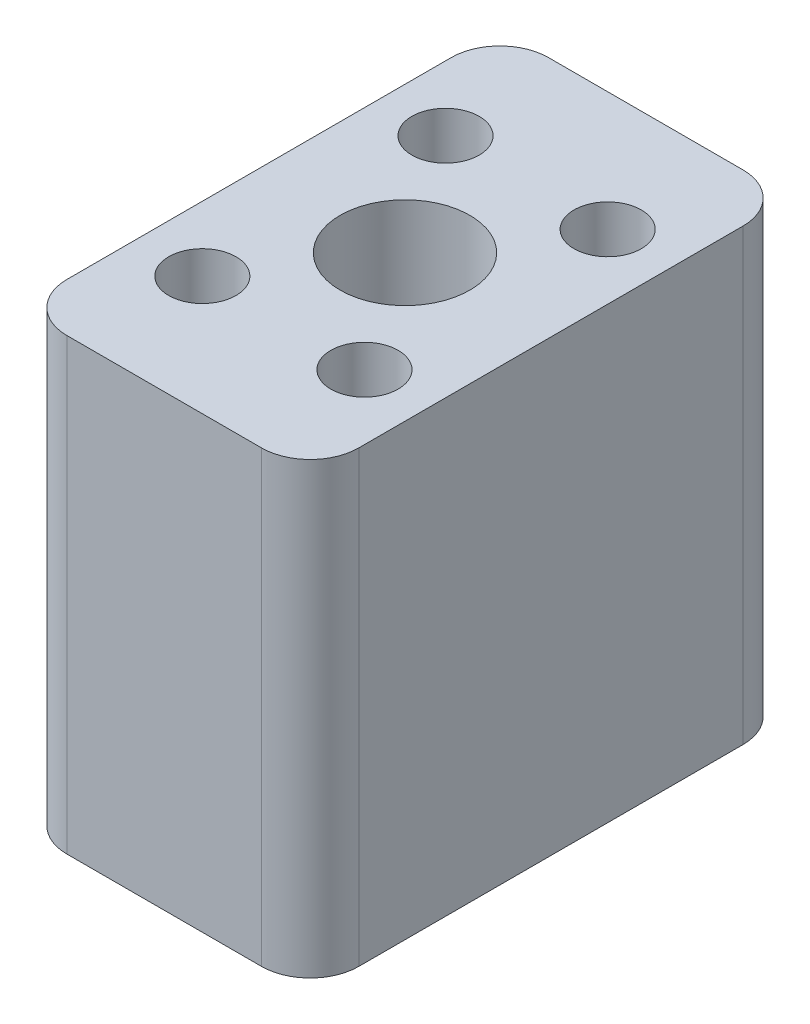
ISO-10303-21;
HEADER;
FILE_DESCRIPTION(('STEP AP214'),'2;1');
FILE_NAME('part.step','',(''),(''),'','','');
FILE_SCHEMA(('AUTOMOTIVE_DESIGN { 1 0 10303 214 1 1 1 1 }'));
ENDSEC;
DATA;
#1=APPLICATION_CONTEXT('core data for automotive mechanical design processes');
#2=APPLICATION_PROTOCOL_DEFINITION('international standard','automotive_design',2000,#1);
#3=PRODUCT_CONTEXT('',#1,'mechanical');
#4=PRODUCT('Part','Part','',(#3));
#5=PRODUCT_RELATED_PRODUCT_CATEGORY('part','',(#4));
#6=PRODUCT_DEFINITION_FORMATION('','',#4);
#7=PRODUCT_DEFINITION_CONTEXT('part definition',#1,'design');
#8=PRODUCT_DEFINITION('design','',#6,#7);
#9=PRODUCT_DEFINITION_SHAPE('','',#8);
#10=(LENGTH_UNIT() NAMED_UNIT(*) SI_UNIT(.MILLI.,.METRE.));
#11=(NAMED_UNIT(*) PLANE_ANGLE_UNIT() SI_UNIT($,.RADIAN.));
#12=(NAMED_UNIT(*) SI_UNIT($,.STERADIAN.) SOLID_ANGLE_UNIT());
#13=UNCERTAINTY_MEASURE_WITH_UNIT(LENGTH_MEASURE(1.E-05),#10,'distance_accuracy_value','');
#14=(GEOMETRIC_REPRESENTATION_CONTEXT(3) GLOBAL_UNCERTAINTY_ASSIGNED_CONTEXT((#13)) GLOBAL_UNIT_ASSIGNED_CONTEXT((#10,
#11,#12)) REPRESENTATION_CONTEXT('',''));
#15=CARTESIAN_POINT('',(0.,0.,0.));
#16=DIRECTION('',(0.,0.,1.));
#17=DIRECTION('',(1.,0.,0.));
#18=AXIS2_PLACEMENT_3D('',#15,#16,#17);
#19=CARTESIAN_POINT('',(9.,27.7,14.85));
#20=DIRECTION('',(-1.,0.,0.));
#21=DIRECTION('',(0.,0.,1.));
#22=AXIS2_PLACEMENT_3D('',#19,#20,#21);
#23=PLANE('',#22);
#24=DIRECTION('',(0.,0.,-1.));
#25=VECTOR('',#24,1.);
#26=CARTESIAN_POINT('',(9.,27.7,14.85));
#27=LINE('',#26,#25);
#28=CARTESIAN_POINT('',(9.,27.7,11.85));
#29=VERTEX_POINT('',#28);
#30=CARTESIAN_POINT('',(9.,27.7,-11.85));
#31=VERTEX_POINT('',#30);
#32=EDGE_CURVE('E120',#29,#31,#27,.T.);
#33=ORIENTED_EDGE('',*,*,#32,.F.);
#34=DIRECTION('',(0.,-1.,0.));
#35=VECTOR('',#34,1.);
#36=CARTESIAN_POINT('',(9.,27.7,11.85));
#37=LINE('',#36,#35);
#38=CARTESIAN_POINT('',(9.,0.,11.85));
#39=VERTEX_POINT('',#38);
#40=EDGE_CURVE('E105',#29,#39,#37,.T.);
#41=ORIENTED_EDGE('',*,*,#40,.T.);
#42=DIRECTION('',(0.,0.,-1.));
#43=VECTOR('',#42,1.);
#44=CARTESIAN_POINT('',(9.,0.,14.85));
#45=LINE('',#44,#43);
#46=CARTESIAN_POINT('',(9.,0.,-11.85));
#47=VERTEX_POINT('',#46);
#48=EDGE_CURVE('E117',#39,#47,#45,.T.);
#49=ORIENTED_EDGE('',*,*,#48,.T.);
#50=DIRECTION('',(0.,-1.,0.));
#51=VECTOR('',#50,1.);
#52=CARTESIAN_POINT('',(9.,27.7,-11.85));
#53=LINE('',#52,#51);
#54=EDGE_CURVE('E122',#47,#31,#53,.F.);
#55=ORIENTED_EDGE('',*,*,#54,.T.);
#56=EDGE_LOOP('',(#33,#41,#49,#55));
#57=FACE_BOUND('',#56,.T.);
#58=ADVANCED_FACE('F35',(#57),#23,.F.);
#59=CARTESIAN_POINT('',(-9.,27.7,-14.85));
#60=DIRECTION('',(0.,0.,1.));
#61=DIRECTION('',(1.,0.,0.));
#62=AXIS2_PLACEMENT_3D('',#59,#60,#61);
#63=PLANE('',#62);
#64=DIRECTION('',(-1.,0.,0.));
#65=VECTOR('',#64,1.);
#66=CARTESIAN_POINT('',(-9.,0.,-14.85));
#67=LINE('',#66,#65);
#68=CARTESIAN_POINT('',(6.,0.,-14.85));
#69=VERTEX_POINT('',#68);
#70=CARTESIAN_POINT('',(-6.,0.,-14.85));
#71=VERTEX_POINT('',#70);
#72=EDGE_CURVE('E126',#69,#71,#67,.T.);
#73=ORIENTED_EDGE('',*,*,#72,.T.);
#74=DIRECTION('',(0.,-1.,0.));
#75=VECTOR('',#74,1.);
#76=CARTESIAN_POINT('',(-6.,27.7,-14.85));
#77=LINE('',#76,#75);
#78=CARTESIAN_POINT('',(-6.,27.7,-14.85));
#79=VERTEX_POINT('',#78);
#80=EDGE_CURVE('E11',#71,#79,#77,.F.);
#81=ORIENTED_EDGE('',*,*,#80,.T.);
#82=DIRECTION('',(-1.,0.,0.));
#83=VECTOR('',#82,1.);
#84=CARTESIAN_POINT('',(-9.,27.7,-14.85));
#85=LINE('',#84,#83);
#86=CARTESIAN_POINT('',(6.,27.7,-14.85));
#87=VERTEX_POINT('',#86);
#88=EDGE_CURVE('E166',#87,#79,#85,.T.);
#89=ORIENTED_EDGE('',*,*,#88,.F.);
#90=DIRECTION('',(0.,-1.,0.));
#91=VECTOR('',#90,1.);
#92=CARTESIAN_POINT('',(6.,27.7,-14.85));
#93=LINE('',#92,#91);
#94=EDGE_CURVE('E43',#87,#69,#93,.T.);
#95=ORIENTED_EDGE('',*,*,#94,.T.);
#96=EDGE_LOOP('',(#73,#81,#89,#95));
#97=FACE_BOUND('',#96,.T.);
#98=ADVANCED_FACE('F164',(#97),#63,.F.);
#99=CARTESIAN_POINT('',(-9.,27.7,14.85));
#100=DIRECTION('',(1.,0.,0.));
#101=DIRECTION('',(0.,0.,-1.));
#102=AXIS2_PLACEMENT_3D('',#99,#100,#101);
#103=PLANE('',#102);
#104=DIRECTION('',(0.,0.,1.));
#105=VECTOR('',#104,1.);
#106=CARTESIAN_POINT('',(-9.,0.,14.85));
#107=LINE('',#106,#105);
#108=CARTESIAN_POINT('',(-9.,0.,-11.85));
#109=VERTEX_POINT('',#108);
#110=CARTESIAN_POINT('',(-9.,0.,11.85));
#111=VERTEX_POINT('',#110);
#112=EDGE_CURVE('E130',#109,#111,#107,.T.);
#113=ORIENTED_EDGE('',*,*,#112,.T.);
#114=DIRECTION('',(0.,-1.,0.));
#115=VECTOR('',#114,1.);
#116=CARTESIAN_POINT('',(-9.,27.7,11.85));
#117=LINE('',#116,#115);
#118=CARTESIAN_POINT('',(-9.,27.7,11.85));
#119=VERTEX_POINT('',#118);
#120=EDGE_CURVE('E50',#111,#119,#117,.F.);
#121=ORIENTED_EDGE('',*,*,#120,.T.);
#122=DIRECTION('',(0.,0.,1.));
#123=VECTOR('',#122,1.);
#124=CARTESIAN_POINT('',(-9.,27.7,14.85));
#125=LINE('',#124,#123);
#126=CARTESIAN_POINT('',(-9.,27.7,-11.85));
#127=VERTEX_POINT('',#126);
#128=EDGE_CURVE('E174',#127,#119,#125,.T.);
#129=ORIENTED_EDGE('',*,*,#128,.F.);
#130=DIRECTION('',(0.,-1.,0.));
#131=VECTOR('',#130,1.);
#132=CARTESIAN_POINT('',(-9.,27.7,-11.85));
#133=LINE('',#132,#131);
#134=EDGE_CURVE('E157',#127,#109,#133,.T.);
#135=ORIENTED_EDGE('',*,*,#134,.T.);
#136=EDGE_LOOP('',(#113,#121,#129,#135));
#137=FACE_BOUND('',#136,.T.);
#138=ADVANCED_FACE('F173',(#137),#103,.F.);
#139=CARTESIAN_POINT('',(-9.,27.7,14.85));
#140=DIRECTION('',(0.,0.,-1.));
#141=DIRECTION('',(-1.,0.,0.));
#142=AXIS2_PLACEMENT_3D('',#139,#140,#141);
#143=PLANE('',#142);
#144=DIRECTION('',(1.,0.,0.));
#145=VECTOR('',#144,1.);
#146=CARTESIAN_POINT('',(-9.,0.,14.85));
#147=LINE('',#146,#145);
#148=CARTESIAN_POINT('',(-6.,0.,14.85));
#149=VERTEX_POINT('',#148);
#150=CARTESIAN_POINT('',(6.,0.,14.85));
#151=VERTEX_POINT('',#150);
#152=EDGE_CURVE('E140',#149,#151,#147,.T.);
#153=ORIENTED_EDGE('',*,*,#152,.T.);
#154=DIRECTION('',(0.,-1.,0.));
#155=VECTOR('',#154,1.);
#156=CARTESIAN_POINT('',(6.,27.7,14.85));
#157=LINE('',#156,#155);
#158=CARTESIAN_POINT('',(6.,27.7,14.85));
#159=VERTEX_POINT('',#158);
#160=EDGE_CURVE('E106',#151,#159,#157,.F.);
#161=ORIENTED_EDGE('',*,*,#160,.T.);
#162=DIRECTION('',(1.,0.,0.));
#163=VECTOR('',#162,1.);
#164=CARTESIAN_POINT('',(-9.,27.7,14.85));
#165=LINE('',#164,#163);
#166=CARTESIAN_POINT('',(-6.,27.7,14.85));
#167=VERTEX_POINT('',#166);
#168=EDGE_CURVE('E136',#167,#159,#165,.T.);
#169=ORIENTED_EDGE('',*,*,#168,.F.);
#170=DIRECTION('',(0.,-1.,0.));
#171=VECTOR('',#170,1.);
#172=CARTESIAN_POINT('',(-6.,27.7,14.85));
#173=LINE('',#172,#171);
#174=EDGE_CURVE('E111',#167,#149,#173,.T.);
#175=ORIENTED_EDGE('',*,*,#174,.T.);
#176=EDGE_LOOP('',(#153,#161,#169,#175));
#177=FACE_BOUND('',#176,.T.);
#178=ADVANCED_FACE('F218',(#177),#143,.F.);
#179=CARTESIAN_POINT('',(0.,27.7,0.));
#180=DIRECTION('',(0.,-1.,0.));
#181=DIRECTION('',(0.,0.,-1.));
#182=AXIS2_PLACEMENT_3D('',#179,#180,#181);
#183=PLANE('',#182);
#184=CARTESIAN_POINT('',(0.,27.7,0.));
#185=DIRECTION('',(0.,1.,0.));
#186=DIRECTION('',(0.,0.,1.));
#187=AXIS2_PLACEMENT_3D('',#184,#185,#186);
#188=CIRCLE('',#187,4.);
#189=CARTESIAN_POINT('',(0.,27.7,4.));
#190=VERTEX_POINT('',#189);
#191=EDGE_CURVE('E201',#190,#190,#188,.T.);
#192=ORIENTED_EDGE('',*,*,#191,.F.);
#193=EDGE_LOOP('',(#192));
#194=FACE_BOUND('',#193,.T.);
#195=CARTESIAN_POINT('',(5.,27.7,7.5));
#196=DIRECTION('',(0.,1.,0.));
#197=DIRECTION('',(0.,0.,1.));
#198=AXIS2_PLACEMENT_3D('',#195,#196,#197);
#199=CIRCLE('',#198,2.075);
#200=CARTESIAN_POINT('',(5.,27.7,9.575));
#201=VERTEX_POINT('',#200);
#202=EDGE_CURVE('E183',#201,#201,#199,.T.);
#203=ORIENTED_EDGE('',*,*,#202,.F.);
#204=EDGE_LOOP('',(#203));
#205=FACE_BOUND('',#204,.T.);
#206=CARTESIAN_POINT('',(-5.,27.7,7.5));
#207=DIRECTION('',(0.,1.,0.));
#208=DIRECTION('',(0.,0.,1.));
#209=AXIS2_PLACEMENT_3D('',#206,#207,#208);
#210=CIRCLE('',#209,2.075);
#211=CARTESIAN_POINT('',(-5.,27.7,9.575));
#212=VERTEX_POINT('',#211);
#213=EDGE_CURVE('E190',#212,#212,#210,.T.);
#214=ORIENTED_EDGE('',*,*,#213,.F.);
#215=EDGE_LOOP('',(#214));
#216=FACE_BOUND('',#215,.T.);
#217=CARTESIAN_POINT('',(-5.,27.7,-7.5));
#218=DIRECTION('',(0.,1.,0.));
#219=DIRECTION('',(0.,0.,1.));
#220=AXIS2_PLACEMENT_3D('',#217,#218,#219);
#221=CIRCLE('',#220,2.075);
#222=CARTESIAN_POINT('',(-5.,27.7,-5.425));
#223=VERTEX_POINT('',#222);
#224=EDGE_CURVE('E196',#223,#223,#221,.T.);
#225=ORIENTED_EDGE('',*,*,#224,.F.);
#226=EDGE_LOOP('',(#225));
#227=FACE_BOUND('',#226,.T.);
#228=CARTESIAN_POINT('',(5.,27.7,-7.5));
#229=DIRECTION('',(0.,1.,0.));
#230=DIRECTION('',(0.,0.,1.));
#231=AXIS2_PLACEMENT_3D('',#228,#229,#230);
#232=CIRCLE('',#231,2.075);
#233=CARTESIAN_POINT('',(5.,27.7,-5.425));
#234=VERTEX_POINT('',#233);
#235=EDGE_CURVE('E133',#234,#234,#232,.T.);
#236=ORIENTED_EDGE('',*,*,#235,.F.);
#237=EDGE_LOOP('',(#236));
#238=FACE_BOUND('',#237,.T.);
#239=ORIENTED_EDGE('',*,*,#168,.T.);
#240=CARTESIAN_POINT('',(6.,27.7,11.85));
#241=DIRECTION('',(0.,-1.,0.));
#242=DIRECTION('',(0.,0.,-1.));
#243=AXIS2_PLACEMENT_3D('',#240,#241,#242);
#244=CIRCLE('',#243,3.);
#245=EDGE_CURVE('E155',#159,#29,#244,.F.);
#246=ORIENTED_EDGE('',*,*,#245,.T.);
#247=ORIENTED_EDGE('',*,*,#32,.T.);
#248=CARTESIAN_POINT('',(6.,27.7,-11.85));
#249=DIRECTION('',(0.,-1.,0.));
#250=DIRECTION('',(0.,0.,-1.));
#251=AXIS2_PLACEMENT_3D('',#248,#249,#250);
#252=CIRCLE('',#251,3.);
#253=EDGE_CURVE('E150',#31,#87,#252,.F.);
#254=ORIENTED_EDGE('',*,*,#253,.T.);
#255=ORIENTED_EDGE('',*,*,#88,.T.);
#256=CARTESIAN_POINT('',(-6.,27.7,-11.85));
#257=DIRECTION('',(0.,-1.,0.));
#258=DIRECTION('',(0.,0.,-1.));
#259=AXIS2_PLACEMENT_3D('',#256,#257,#258);
#260=CIRCLE('',#259,3.);
#261=EDGE_CURVE('E57',#79,#127,#260,.F.);
#262=ORIENTED_EDGE('',*,*,#261,.T.);
#263=ORIENTED_EDGE('',*,*,#128,.T.);
#264=CARTESIAN_POINT('',(-6.,27.7,11.85));
#265=DIRECTION('',(0.,-1.,0.));
#266=DIRECTION('',(0.,0.,-1.));
#267=AXIS2_PLACEMENT_3D('',#264,#265,#266);
#268=CIRCLE('',#267,3.);
#269=EDGE_CURVE('E153',#119,#167,#268,.F.);
#270=ORIENTED_EDGE('',*,*,#269,.T.);
#271=EDGE_LOOP('',(#239,#246,#247,#254,#255,#262,#263,#270));
#272=FACE_BOUND('',#271,.T.);
#273=ADVANCED_FACE('F215',(#194,#205,#216,#227,#238,#272),#183,.F.);
#274=CARTESIAN_POINT('',(0.,0.,0.));
#275=DIRECTION('',(0.,-1.,0.));
#276=DIRECTION('',(0.,0.,-1.));
#277=AXIS2_PLACEMENT_3D('',#274,#275,#276);
#278=PLANE('',#277);
#279=CARTESIAN_POINT('',(0.,0.,0.));
#280=DIRECTION('',(0.,1.,0.));
#281=DIRECTION('',(0.,0.,1.));
#282=AXIS2_PLACEMENT_3D('',#279,#280,#281);
#283=CIRCLE('',#282,4.);
#284=CARTESIAN_POINT('',(0.,0.,4.));
#285=VERTEX_POINT('',#284);
#286=EDGE_CURVE('E187',#285,#285,#283,.T.);
#287=ORIENTED_EDGE('',*,*,#286,.T.);
#288=EDGE_LOOP('',(#287));
#289=FACE_BOUND('',#288,.T.);
#290=CARTESIAN_POINT('',(5.,0.,7.5));
#291=DIRECTION('',(0.,1.,0.));
#292=DIRECTION('',(0.,0.,1.));
#293=AXIS2_PLACEMENT_3D('',#290,#291,#292);
#294=CIRCLE('',#293,2.075);
#295=CARTESIAN_POINT('',(5.,0.,9.575));
#296=VERTEX_POINT('',#295);
#297=EDGE_CURVE('E186',#296,#296,#294,.T.);
#298=ORIENTED_EDGE('',*,*,#297,.T.);
#299=EDGE_LOOP('',(#298));
#300=FACE_BOUND('',#299,.T.);
#301=CARTESIAN_POINT('',(-5.,0.,7.5));
#302=DIRECTION('',(0.,1.,0.));
#303=DIRECTION('',(0.,0.,1.));
#304=AXIS2_PLACEMENT_3D('',#301,#302,#303);
#305=CIRCLE('',#304,2.075);
#306=CARTESIAN_POINT('',(-5.,0.,9.575));
#307=VERTEX_POINT('',#306);
#308=EDGE_CURVE('E193',#307,#307,#305,.T.);
#309=ORIENTED_EDGE('',*,*,#308,.T.);
#310=EDGE_LOOP('',(#309));
#311=FACE_BOUND('',#310,.T.);
#312=CARTESIAN_POINT('',(-5.,0.,-7.5));
#313=DIRECTION('',(0.,1.,0.));
#314=DIRECTION('',(0.,0.,1.));
#315=AXIS2_PLACEMENT_3D('',#312,#313,#314);
#316=CIRCLE('',#315,2.075);
#317=CARTESIAN_POINT('',(-5.,0.,-5.425));
#318=VERTEX_POINT('',#317);
#319=EDGE_CURVE('E181',#318,#318,#316,.T.);
#320=ORIENTED_EDGE('',*,*,#319,.T.);
#321=EDGE_LOOP('',(#320));
#322=FACE_BOUND('',#321,.T.);
#323=CARTESIAN_POINT('',(5.,0.,-7.5));
#324=DIRECTION('',(0.,1.,0.));
#325=DIRECTION('',(0.,0.,1.));
#326=AXIS2_PLACEMENT_3D('',#323,#324,#325);
#327=CIRCLE('',#326,2.075);
#328=CARTESIAN_POINT('',(5.,0.,-5.425));
#329=VERTEX_POINT('',#328);
#330=EDGE_CURVE('E127',#329,#329,#327,.T.);
#331=ORIENTED_EDGE('',*,*,#330,.T.);
#332=EDGE_LOOP('',(#331));
#333=FACE_BOUND('',#332,.T.);
#334=ORIENTED_EDGE('',*,*,#48,.F.);
#335=CARTESIAN_POINT('',(6.,0.,11.85));
#336=DIRECTION('',(0.,-1.,0.));
#337=DIRECTION('',(0.,0.,-1.));
#338=AXIS2_PLACEMENT_3D('',#335,#336,#337);
#339=CIRCLE('',#338,3.);
#340=EDGE_CURVE('E101',#39,#151,#339,.T.);
#341=ORIENTED_EDGE('',*,*,#340,.T.);
#342=ORIENTED_EDGE('',*,*,#152,.F.);
#343=CARTESIAN_POINT('',(-6.,0.,11.85));
#344=DIRECTION('',(0.,-1.,0.));
#345=DIRECTION('',(0.,0.,-1.));
#346=AXIS2_PLACEMENT_3D('',#343,#344,#345);
#347=CIRCLE('',#346,3.);
#348=EDGE_CURVE('E112',#149,#111,#347,.T.);
#349=ORIENTED_EDGE('',*,*,#348,.T.);
#350=ORIENTED_EDGE('',*,*,#112,.F.);
#351=CARTESIAN_POINT('',(-6.,0.,-11.85));
#352=DIRECTION('',(0.,-1.,0.));
#353=DIRECTION('',(0.,0.,-1.));
#354=AXIS2_PLACEMENT_3D('',#351,#352,#353);
#355=CIRCLE('',#354,3.);
#356=EDGE_CURVE('E144',#109,#71,#355,.T.);
#357=ORIENTED_EDGE('',*,*,#356,.T.);
#358=ORIENTED_EDGE('',*,*,#72,.F.);
#359=CARTESIAN_POINT('',(6.,0.,-11.85));
#360=DIRECTION('',(0.,-1.,0.));
#361=DIRECTION('',(0.,0.,-1.));
#362=AXIS2_PLACEMENT_3D('',#359,#360,#361);
#363=CIRCLE('',#362,3.);
#364=EDGE_CURVE('E121',#69,#47,#363,.T.);
#365=ORIENTED_EDGE('',*,*,#364,.T.);
#366=EDGE_LOOP('',(#334,#341,#342,#349,#350,#357,#358,#365));
#367=FACE_BOUND('',#366,.T.);
#368=ADVANCED_FACE('F124',(#289,#300,#311,#322,#333,#367),#278,.T.);
#369=CARTESIAN_POINT('',(5.,0.,-7.5));
#370=DIRECTION('',(0.,1.,0.));
#371=DIRECTION('',(0.,0.,1.));
#372=AXIS2_PLACEMENT_3D('',#369,#370,#371);
#373=CYLINDRICAL_SURFACE('',#372,2.075);
#374=ORIENTED_EDGE('',*,*,#330,.F.);
#375=EDGE_LOOP('',(#374));
#376=FACE_BOUND('',#375,.T.);
#377=ORIENTED_EDGE('',*,*,#235,.T.);
#378=EDGE_LOOP('',(#377));
#379=FACE_BOUND('',#378,.T.);
#380=ADVANCED_FACE('F252',(#376,#379),#373,.F.);
#381=CARTESIAN_POINT('',(-5.,0.,-7.5));
#382=DIRECTION('',(0.,1.,0.));
#383=DIRECTION('',(0.,0.,1.));
#384=AXIS2_PLACEMENT_3D('',#381,#382,#383);
#385=CYLINDRICAL_SURFACE('',#384,2.075);
#386=ORIENTED_EDGE('',*,*,#319,.F.);
#387=EDGE_LOOP('',(#386));
#388=FACE_BOUND('',#387,.T.);
#389=ORIENTED_EDGE('',*,*,#224,.T.);
#390=EDGE_LOOP('',(#389));
#391=FACE_BOUND('',#390,.T.);
#392=ADVANCED_FACE('F256',(#388,#391),#385,.F.);
#393=CARTESIAN_POINT('',(-5.,0.,7.5));
#394=DIRECTION('',(0.,1.,0.));
#395=DIRECTION('',(0.,0.,1.));
#396=AXIS2_PLACEMENT_3D('',#393,#394,#395);
#397=CYLINDRICAL_SURFACE('',#396,2.075);
#398=ORIENTED_EDGE('',*,*,#308,.F.);
#399=EDGE_LOOP('',(#398));
#400=FACE_BOUND('',#399,.T.);
#401=ORIENTED_EDGE('',*,*,#213,.T.);
#402=EDGE_LOOP('',(#401));
#403=FACE_BOUND('',#402,.T.);
#404=ADVANCED_FACE('F260',(#400,#403),#397,.F.);
#405=CARTESIAN_POINT('',(5.,0.,7.5));
#406=DIRECTION('',(0.,1.,0.));
#407=DIRECTION('',(0.,0.,1.));
#408=AXIS2_PLACEMENT_3D('',#405,#406,#407);
#409=CYLINDRICAL_SURFACE('',#408,2.075);
#410=ORIENTED_EDGE('',*,*,#297,.F.);
#411=EDGE_LOOP('',(#410));
#412=FACE_BOUND('',#411,.T.);
#413=ORIENTED_EDGE('',*,*,#202,.T.);
#414=EDGE_LOOP('',(#413));
#415=FACE_BOUND('',#414,.T.);
#416=ADVANCED_FACE('F238',(#412,#415),#409,.F.);
#417=CARTESIAN_POINT('',(6.,27.7,11.85));
#418=DIRECTION('',(0.,-1.,0.));
#419=DIRECTION('',(0.,0.,-1.));
#420=AXIS2_PLACEMENT_3D('',#417,#418,#419);
#421=CYLINDRICAL_SURFACE('',#420,3.);
#422=ORIENTED_EDGE('',*,*,#245,.F.);
#423=ORIENTED_EDGE('',*,*,#160,.F.);
#424=ORIENTED_EDGE('',*,*,#340,.F.);
#425=ORIENTED_EDGE('',*,*,#40,.F.);
#426=EDGE_LOOP('',(#422,#423,#424,#425));
#427=FACE_BOUND('',#426,.T.);
#428=ADVANCED_FACE('F104',(#427),#421,.T.);
#429=CARTESIAN_POINT('',(-6.,27.7,11.85));
#430=DIRECTION('',(0.,-1.,0.));
#431=DIRECTION('',(0.,0.,-1.));
#432=AXIS2_PLACEMENT_3D('',#429,#430,#431);
#433=CYLINDRICAL_SURFACE('',#432,3.);
#434=ORIENTED_EDGE('',*,*,#269,.F.);
#435=ORIENTED_EDGE('',*,*,#120,.F.);
#436=ORIENTED_EDGE('',*,*,#348,.F.);
#437=ORIENTED_EDGE('',*,*,#174,.F.);
#438=EDGE_LOOP('',(#434,#435,#436,#437));
#439=FACE_BOUND('',#438,.T.);
#440=ADVANCED_FACE('F231',(#439),#433,.T.);
#441=CARTESIAN_POINT('',(-6.,27.7,-11.85));
#442=DIRECTION('',(0.,-1.,0.));
#443=DIRECTION('',(0.,0.,-1.));
#444=AXIS2_PLACEMENT_3D('',#441,#442,#443);
#445=CYLINDRICAL_SURFACE('',#444,3.);
#446=ORIENTED_EDGE('',*,*,#261,.F.);
#447=ORIENTED_EDGE('',*,*,#80,.F.);
#448=ORIENTED_EDGE('',*,*,#356,.F.);
#449=ORIENTED_EDGE('',*,*,#134,.F.);
#450=EDGE_LOOP('',(#446,#447,#448,#449));
#451=FACE_BOUND('',#450,.T.);
#452=ADVANCED_FACE('F172',(#451),#445,.T.);
#453=CARTESIAN_POINT('',(6.,27.7,-11.85));
#454=DIRECTION('',(0.,-1.,0.));
#455=DIRECTION('',(0.,0.,-1.));
#456=AXIS2_PLACEMENT_3D('',#453,#454,#455);
#457=CYLINDRICAL_SURFACE('',#456,3.);
#458=ORIENTED_EDGE('',*,*,#253,.F.);
#459=ORIENTED_EDGE('',*,*,#54,.F.);
#460=ORIENTED_EDGE('',*,*,#364,.F.);
#461=ORIENTED_EDGE('',*,*,#94,.F.);
#462=EDGE_LOOP('',(#458,#459,#460,#461));
#463=FACE_BOUND('',#462,.T.);
#464=ADVANCED_FACE('F37',(#463),#457,.T.);
#465=CARTESIAN_POINT('',(0.,0.,0.));
#466=DIRECTION('',(0.,1.,0.));
#467=DIRECTION('',(0.,0.,1.));
#468=AXIS2_PLACEMENT_3D('',#465,#466,#467);
#469=CYLINDRICAL_SURFACE('',#468,4.);
#470=ORIENTED_EDGE('',*,*,#286,.F.);
#471=EDGE_LOOP('',(#470));
#472=FACE_BOUND('',#471,.T.);
#473=ORIENTED_EDGE('',*,*,#191,.T.);
#474=EDGE_LOOP('',(#473));
#475=FACE_BOUND('',#474,.T.);
#476=ADVANCED_FACE('F209',(#472,#475),#469,.F.);
#477=CLOSED_SHELL('',(#58,#98,#138,#178,#273,#368,#380,#392,#404,#416,#428,#440,#452,#464,#476));
#478=MANIFOLD_SOLID_BREP('B2',#477);
#479=ADVANCED_BREP_SHAPE_REPRESENTATION('',(#18,#478),#14);
#480=SHAPE_DEFINITION_REPRESENTATION(#9,#479);
ENDSEC;
END-ISO-10303-21;
